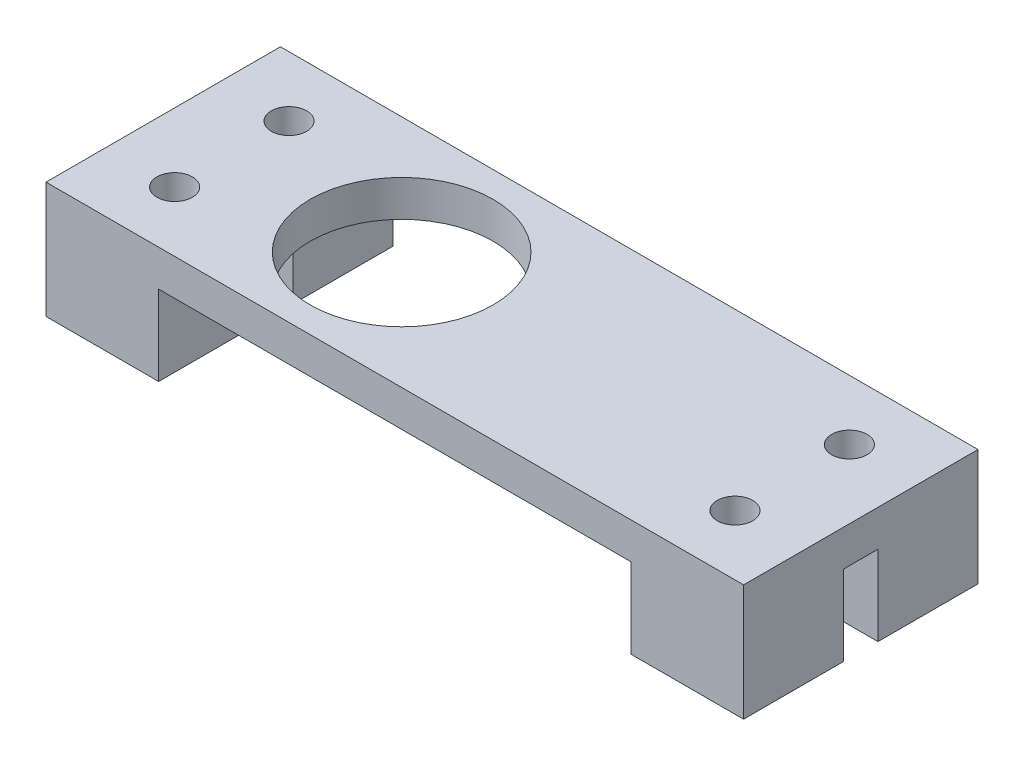
ISO-10303-21;
HEADER;
FILE_DESCRIPTION(('STEP AP214'),'2;1');
FILE_NAME('part.step','',(''),(''),'','','');
FILE_SCHEMA(('AUTOMOTIVE_DESIGN { 1 0 10303 214 1 1 1 1 }'));
ENDSEC;
DATA;
#1=APPLICATION_CONTEXT('core data for automotive mechanical design processes');
#2=APPLICATION_PROTOCOL_DEFINITION('international standard','automotive_design',2000,#1);
#3=PRODUCT_CONTEXT('',#1,'mechanical');
#4=PRODUCT('Part','Part','',(#3));
#5=PRODUCT_RELATED_PRODUCT_CATEGORY('part','',(#4));
#6=PRODUCT_DEFINITION_FORMATION('','',#4);
#7=PRODUCT_DEFINITION_CONTEXT('part definition',#1,'design');
#8=PRODUCT_DEFINITION('design','',#6,#7);
#9=PRODUCT_DEFINITION_SHAPE('','',#8);
#10=(LENGTH_UNIT() NAMED_UNIT(*) SI_UNIT(.MILLI.,.METRE.));
#11=(NAMED_UNIT(*) PLANE_ANGLE_UNIT() SI_UNIT($,.RADIAN.));
#12=(NAMED_UNIT(*) SI_UNIT($,.STERADIAN.) SOLID_ANGLE_UNIT());
#13=UNCERTAINTY_MEASURE_WITH_UNIT(LENGTH_MEASURE(1.E-05),#10,'distance_accuracy_value','');
#14=(GEOMETRIC_REPRESENTATION_CONTEXT(3) GLOBAL_UNCERTAINTY_ASSIGNED_CONTEXT((#13)) GLOBAL_UNIT_ASSIGNED_CONTEXT((#10,
#11,#12)) REPRESENTATION_CONTEXT('',''));
#15=CARTESIAN_POINT('',(0.,0.,0.));
#16=DIRECTION('',(0.,0.,1.));
#17=DIRECTION('',(1.,0.,0.));
#18=AXIS2_PLACEMENT_3D('',#15,#16,#17);
#19=CARTESIAN_POINT('',(0.,0.,0.));
#20=DIRECTION('',(0.,1.,0.));
#21=DIRECTION('',(0.,0.,1.));
#22=AXIS2_PLACEMENT_3D('',#19,#20,#21);
#23=PLANE('',#22);
#24=CARTESIAN_POINT('',(-9.65,0.,0.));
#25=DIRECTION('',(0.,1.,0.));
#26=DIRECTION('',(0.,0.,1.));
#27=AXIS2_PLACEMENT_3D('',#24,#25,#26);
#28=CIRCLE('',#27,8.);
#29=CARTESIAN_POINT('',(-9.65,0.,8.));
#30=VERTEX_POINT('',#29);
#31=EDGE_CURVE('E262',#30,#30,#28,.T.);
#32=ORIENTED_EDGE('',*,*,#31,.T.);
#33=EDGE_LOOP('',(#32));
#34=FACE_BOUND('',#33,.T.);
#35=DIRECTION('',(0.,0.,-1.));
#36=VECTOR('',#35,1.);
#37=CARTESIAN_POINT('',(20.65,0.,0.));
#38=LINE('',#37,#36);
#39=CARTESIAN_POINT('',(20.65,0.,-1.5));
#40=VERTEX_POINT('',#39);
#41=CARTESIAN_POINT('',(20.65,0.,-10.25));
#42=VERTEX_POINT('',#41);
#43=EDGE_CURVE('E52',#40,#42,#38,.T.);
#44=ORIENTED_EDGE('',*,*,#43,.F.);
#45=DIRECTION('',(1.,0.,0.));
#46=VECTOR('',#45,1.);
#47=CARTESIAN_POINT('',(0.,0.,-1.5));
#48=LINE('',#47,#46);
#49=CARTESIAN_POINT('',(30.5,0.,-1.5));
#50=VERTEX_POINT('',#49);
#51=EDGE_CURVE('E57',#40,#50,#48,.T.);
#52=ORIENTED_EDGE('',*,*,#51,.T.);
#53=DIRECTION('',(0.,0.,1.));
#54=VECTOR('',#53,1.);
#55=CARTESIAN_POINT('',(30.5,0.,0.));
#56=LINE('',#55,#54);
#57=CARTESIAN_POINT('',(30.5,0.,1.5));
#58=VERTEX_POINT('',#57);
#59=EDGE_CURVE('E293',#50,#58,#56,.T.);
#60=ORIENTED_EDGE('',*,*,#59,.T.);
#61=DIRECTION('',(1.,0.,0.));
#62=VECTOR('',#61,1.);
#63=CARTESIAN_POINT('',(0.,0.,1.5));
#64=LINE('',#63,#62);
#65=CARTESIAN_POINT('',(20.65,0.,1.5));
#66=VERTEX_POINT('',#65);
#67=EDGE_CURVE('E187',#66,#58,#64,.T.);
#68=ORIENTED_EDGE('',*,*,#67,.F.);
#69=DIRECTION('',(0.,0.,-1.));
#70=VECTOR('',#69,1.);
#71=CARTESIAN_POINT('',(20.65,0.,0.));
#72=LINE('',#71,#70);
#73=CARTESIAN_POINT('',(20.65,0.,10.25));
#74=VERTEX_POINT('',#73);
#75=EDGE_CURVE('E154',#74,#66,#72,.T.);
#76=ORIENTED_EDGE('',*,*,#75,.F.);
#77=DIRECTION('',(1.,0.,0.));
#78=VECTOR('',#77,1.);
#79=CARTESIAN_POINT('',(0.,0.,10.25));
#80=LINE('',#79,#78);
#81=CARTESIAN_POINT('',(-20.65,0.,10.25));
#82=VERTEX_POINT('',#81);
#83=EDGE_CURVE('E267',#82,#74,#80,.T.);
#84=ORIENTED_EDGE('',*,*,#83,.F.);
#85=DIRECTION('',(0.,0.,-1.));
#86=VECTOR('',#85,1.);
#87=CARTESIAN_POINT('',(-20.65,0.,0.));
#88=LINE('',#87,#86);
#89=CARTESIAN_POINT('',(-20.65,0.,1.5));
#90=VERTEX_POINT('',#89);
#91=EDGE_CURVE('E239',#82,#90,#88,.T.);
#92=ORIENTED_EDGE('',*,*,#91,.T.);
#93=DIRECTION('',(1.,0.,0.));
#94=VECTOR('',#93,1.);
#95=CARTESIAN_POINT('',(0.,0.,1.5));
#96=LINE('',#95,#94);
#97=CARTESIAN_POINT('',(-30.5,0.,1.5));
#98=VERTEX_POINT('',#97);
#99=EDGE_CURVE('E234',#98,#90,#96,.T.);
#100=ORIENTED_EDGE('',*,*,#99,.F.);
#101=DIRECTION('',(0.,0.,1.));
#102=VECTOR('',#101,1.);
#103=CARTESIAN_POINT('',(-30.5,0.,0.));
#104=LINE('',#103,#102);
#105=CARTESIAN_POINT('',(-30.5,0.,-1.5));
#106=VERTEX_POINT('',#105);
#107=EDGE_CURVE('E297',#106,#98,#104,.T.);
#108=ORIENTED_EDGE('',*,*,#107,.F.);
#109=DIRECTION('',(1.,0.,0.));
#110=VECTOR('',#109,1.);
#111=CARTESIAN_POINT('',(0.,0.,-1.5));
#112=LINE('',#111,#110);
#113=CARTESIAN_POINT('',(-20.65,0.,-1.5));
#114=VERTEX_POINT('',#113);
#115=EDGE_CURVE('E208',#106,#114,#112,.T.);
#116=ORIENTED_EDGE('',*,*,#115,.T.);
#117=DIRECTION('',(0.,0.,-1.));
#118=VECTOR('',#117,1.);
#119=CARTESIAN_POINT('',(-20.65,0.,0.));
#120=LINE('',#119,#118);
#121=CARTESIAN_POINT('',(-20.65,0.,-10.25));
#122=VERTEX_POINT('',#121);
#123=EDGE_CURVE('E213',#114,#122,#120,.T.);
#124=ORIENTED_EDGE('',*,*,#123,.T.);
#125=DIRECTION('',(1.,0.,0.));
#126=VECTOR('',#125,1.);
#127=CARTESIAN_POINT('',(0.,0.,-10.25));
#128=LINE('',#127,#126);
#129=EDGE_CURVE('E295',#122,#42,#128,.T.);
#130=ORIENTED_EDGE('',*,*,#129,.T.);
#131=EDGE_LOOP('',(#44,#52,#60,#68,#76,#84,#92,#100,#108,#116,#124,#130));
#132=FACE_BOUND('',#131,.T.);
#133=ADVANCED_FACE('F37',(#34,#132),#23,.F.);
#134=CARTESIAN_POINT('',(30.5,3.175,0.));
#135=DIRECTION('',(1.,0.,0.));
#136=DIRECTION('',(0.,0.,-1.));
#137=AXIS2_PLACEMENT_3D('',#134,#135,#136);
#138=PLANE('',#137);
#139=ORIENTED_EDGE('',*,*,#59,.F.);
#140=DIRECTION('',(0.,1.,0.));
#141=VECTOR('',#140,1.);
#142=CARTESIAN_POINT('',(30.5,-7.,-1.5));
#143=LINE('',#142,#141);
#144=CARTESIAN_POINT('',(30.5,-7.,-1.5));
#145=VERTEX_POINT('',#144);
#146=EDGE_CURVE('E179',#145,#50,#143,.T.);
#147=ORIENTED_EDGE('',*,*,#146,.F.);
#148=DIRECTION('',(0.,0.,1.));
#149=VECTOR('',#148,1.);
#150=CARTESIAN_POINT('',(30.5,-7.,0.));
#151=LINE('',#150,#149);
#152=CARTESIAN_POINT('',(30.5,-7.,-10.25));
#153=VERTEX_POINT('',#152);
#154=EDGE_CURVE('E169',#153,#145,#151,.T.);
#155=ORIENTED_EDGE('',*,*,#154,.F.);
#156=DIRECTION('',(0.,-1.,0.));
#157=VECTOR('',#156,1.);
#158=CARTESIAN_POINT('',(30.5,3.175,-10.25));
#159=LINE('',#158,#157);
#160=CARTESIAN_POINT('',(30.5,3.175,-10.25));
#161=VERTEX_POINT('',#160);
#162=EDGE_CURVE('E11',#161,#153,#159,.T.);
#163=ORIENTED_EDGE('',*,*,#162,.F.);
#164=DIRECTION('',(0.,0.,1.));
#165=VECTOR('',#164,1.);
#166=CARTESIAN_POINT('',(30.5,3.175,0.));
#167=LINE('',#166,#165);
#168=CARTESIAN_POINT('',(30.5,3.175,10.25));
#169=VERTEX_POINT('',#168);
#170=EDGE_CURVE('E279',#161,#169,#167,.T.);
#171=ORIENTED_EDGE('',*,*,#170,.T.);
#172=DIRECTION('',(0.,-1.,0.));
#173=VECTOR('',#172,1.);
#174=CARTESIAN_POINT('',(30.5,3.175,10.25));
#175=LINE('',#174,#173);
#176=CARTESIAN_POINT('',(30.5,-7.,10.25));
#177=VERTEX_POINT('',#176);
#178=EDGE_CURVE('E290',#169,#177,#175,.T.);
#179=ORIENTED_EDGE('',*,*,#178,.T.);
#180=DIRECTION('',(0.,0.,1.));
#181=VECTOR('',#180,1.);
#182=CARTESIAN_POINT('',(30.5,-7.,0.));
#183=LINE('',#182,#181);
#184=CARTESIAN_POINT('',(30.5,-7.,1.5));
#185=VERTEX_POINT('',#184);
#186=EDGE_CURVE('E192',#185,#177,#183,.T.);
#187=ORIENTED_EDGE('',*,*,#186,.F.);
#188=DIRECTION('',(0.,1.,0.));
#189=VECTOR('',#188,1.);
#190=CARTESIAN_POINT('',(30.5,-7.,1.5));
#191=LINE('',#190,#189);
#192=EDGE_CURVE('E203',#185,#58,#191,.T.);
#193=ORIENTED_EDGE('',*,*,#192,.T.);
#194=EDGE_LOOP('',(#139,#147,#155,#163,#171,#179,#187,#193));
#195=FACE_BOUND('',#194,.T.);
#196=ADVANCED_FACE('F345',(#195),#138,.T.);
#197=CARTESIAN_POINT('',(0.,3.175,-10.25));
#198=DIRECTION('',(0.,0.,-1.));
#199=DIRECTION('',(-1.,0.,0.));
#200=AXIS2_PLACEMENT_3D('',#197,#198,#199);
#201=PLANE('',#200);
#202=ORIENTED_EDGE('',*,*,#129,.F.);
#203=DIRECTION('',(0.,1.,0.));
#204=VECTOR('',#203,1.);
#205=CARTESIAN_POINT('',(-20.65,-7.,-10.25));
#206=LINE('',#205,#204);
#207=CARTESIAN_POINT('',(-20.65,-7.,-10.25));
#208=VERTEX_POINT('',#207);
#209=EDGE_CURVE('E230',#208,#122,#206,.T.);
#210=ORIENTED_EDGE('',*,*,#209,.F.);
#211=DIRECTION('',(1.,0.,0.));
#212=VECTOR('',#211,1.);
#213=CARTESIAN_POINT('',(0.,-7.,-10.25));
#214=LINE('',#213,#212);
#215=CARTESIAN_POINT('',(-30.5,-7.,-10.25));
#216=VERTEX_POINT('',#215);
#217=EDGE_CURVE('E216',#216,#208,#214,.T.);
#218=ORIENTED_EDGE('',*,*,#217,.F.);
#219=DIRECTION('',(0.,-1.,0.));
#220=VECTOR('',#219,1.);
#221=CARTESIAN_POINT('',(-30.5,3.175,-10.25));
#222=LINE('',#221,#220);
#223=CARTESIAN_POINT('',(-30.5,3.175,-10.25));
#224=VERTEX_POINT('',#223);
#225=EDGE_CURVE('E45',#224,#216,#222,.T.);
#226=ORIENTED_EDGE('',*,*,#225,.F.);
#227=DIRECTION('',(1.,0.,0.));
#228=VECTOR('',#227,1.);
#229=CARTESIAN_POINT('',(0.,3.175,-10.25));
#230=LINE('',#229,#228);
#231=EDGE_CURVE('E282',#224,#161,#230,.T.);
#232=ORIENTED_EDGE('',*,*,#231,.T.);
#233=ORIENTED_EDGE('',*,*,#162,.T.);
#234=DIRECTION('',(1.,0.,0.));
#235=VECTOR('',#234,1.);
#236=CARTESIAN_POINT('',(0.,-7.,-10.25));
#237=LINE('',#236,#235);
#238=CARTESIAN_POINT('',(20.65,-7.,-10.25));
#239=VERTEX_POINT('',#238);
#240=EDGE_CURVE('E164',#239,#153,#237,.T.);
#241=ORIENTED_EDGE('',*,*,#240,.F.);
#242=DIRECTION('',(0.,1.,0.));
#243=VECTOR('',#242,1.);
#244=CARTESIAN_POINT('',(20.65,-7.,-10.25));
#245=LINE('',#244,#243);
#246=EDGE_CURVE('E155',#239,#42,#245,.T.);
#247=ORIENTED_EDGE('',*,*,#246,.T.);
#248=EDGE_LOOP('',(#202,#210,#218,#226,#232,#233,#241,#247));
#249=FACE_BOUND('',#248,.T.);
#250=ADVANCED_FACE('F318',(#249),#201,.T.);
#251=CARTESIAN_POINT('',(-30.5,3.175,0.));
#252=DIRECTION('',(1.,0.,0.));
#253=DIRECTION('',(0.,0.,-1.));
#254=AXIS2_PLACEMENT_3D('',#251,#252,#253);
#255=PLANE('',#254);
#256=ORIENTED_EDGE('',*,*,#225,.T.);
#257=DIRECTION('',(0.,0.,-1.));
#258=VECTOR('',#257,1.);
#259=CARTESIAN_POINT('',(-30.5,-7.,0.));
#260=LINE('',#259,#258);
#261=CARTESIAN_POINT('',(-30.5,-7.,-1.5));
#262=VERTEX_POINT('',#261);
#263=EDGE_CURVE('E212',#262,#216,#260,.T.);
#264=ORIENTED_EDGE('',*,*,#263,.F.);
#265=DIRECTION('',(0.,1.,0.));
#266=VECTOR('',#265,1.);
#267=CARTESIAN_POINT('',(-30.5,-7.,-1.5));
#268=LINE('',#267,#266);
#269=EDGE_CURVE('E232',#262,#106,#268,.T.);
#270=ORIENTED_EDGE('',*,*,#269,.T.);
#271=ORIENTED_EDGE('',*,*,#107,.T.);
#272=DIRECTION('',(0.,1.,0.));
#273=VECTOR('',#272,1.);
#274=CARTESIAN_POINT('',(-30.5,-7.,1.5));
#275=LINE('',#274,#273);
#276=CARTESIAN_POINT('',(-30.5,-7.,1.5));
#277=VERTEX_POINT('',#276);
#278=EDGE_CURVE('E259',#277,#98,#275,.T.);
#279=ORIENTED_EDGE('',*,*,#278,.F.);
#280=DIRECTION('',(0.,0.,-1.));
#281=VECTOR('',#280,1.);
#282=CARTESIAN_POINT('',(-30.5,-7.,0.));
#283=LINE('',#282,#281);
#284=CARTESIAN_POINT('',(-30.5,-7.,10.25));
#285=VERTEX_POINT('',#284);
#286=EDGE_CURVE('E238',#285,#277,#283,.T.);
#287=ORIENTED_EDGE('',*,*,#286,.F.);
#288=DIRECTION('',(0.,-1.,0.));
#289=VECTOR('',#288,1.);
#290=CARTESIAN_POINT('',(-30.5,3.175,10.25));
#291=LINE('',#290,#289);
#292=CARTESIAN_POINT('',(-30.5,3.175,10.25));
#293=VERTEX_POINT('',#292);
#294=EDGE_CURVE('E302',#293,#285,#291,.T.);
#295=ORIENTED_EDGE('',*,*,#294,.F.);
#296=DIRECTION('',(0.,0.,1.));
#297=VECTOR('',#296,1.);
#298=CARTESIAN_POINT('',(-30.5,3.175,0.));
#299=LINE('',#298,#297);
#300=EDGE_CURVE('E285',#224,#293,#299,.T.);
#301=ORIENTED_EDGE('',*,*,#300,.F.);
#302=EDGE_LOOP('',(#256,#264,#270,#271,#279,#287,#295,#301));
#303=FACE_BOUND('',#302,.T.);
#304=ADVANCED_FACE('F306',(#303),#255,.F.);
#305=CARTESIAN_POINT('',(-9.65,3.175,0.));
#306=DIRECTION('',(0.,-1.,0.));
#307=DIRECTION('',(0.,0.,-1.));
#308=AXIS2_PLACEMENT_3D('',#305,#306,#307);
#309=CYLINDRICAL_SURFACE('',#308,8.);
#310=CARTESIAN_POINT('',(-9.65,3.175,0.));
#311=DIRECTION('',(0.,1.,0.));
#312=DIRECTION('',(0.,0.,1.));
#313=AXIS2_PLACEMENT_3D('',#310,#311,#312);
#314=CIRCLE('',#313,8.);
#315=CARTESIAN_POINT('',(-9.65,3.175,8.));
#316=VERTEX_POINT('',#315);
#317=EDGE_CURVE('E276',#316,#316,#314,.T.);
#318=ORIENTED_EDGE('',*,*,#317,.T.);
#319=EDGE_LOOP('',(#318));
#320=FACE_BOUND('',#319,.T.);
#321=ORIENTED_EDGE('',*,*,#31,.F.);
#322=EDGE_LOOP('',(#321));
#323=FACE_BOUND('',#322,.T.);
#324=ADVANCED_FACE('F381',(#320,#323),#309,.F.);
#325=CARTESIAN_POINT('',(-24.5,3.175,-5.));
#326=DIRECTION('',(0.,-1.,0.));
#327=DIRECTION('',(0.,0.,-1.));
#328=AXIS2_PLACEMENT_3D('',#325,#326,#327);
#329=CYLINDRICAL_SURFACE('',#328,1.55);
#330=CARTESIAN_POINT('',(-24.5,3.175,-5.));
#331=DIRECTION('',(0.,1.,0.));
#332=DIRECTION('',(0.,0.,1.));
#333=AXIS2_PLACEMENT_3D('',#330,#331,#332);
#334=CIRCLE('',#333,1.55);
#335=CARTESIAN_POINT('',(-24.5,3.175,-3.45));
#336=VERTEX_POINT('',#335);
#337=EDGE_CURVE('E273',#336,#336,#334,.T.);
#338=ORIENTED_EDGE('',*,*,#337,.T.);
#339=EDGE_LOOP('',(#338));
#340=FACE_BOUND('',#339,.T.);
#341=CARTESIAN_POINT('',(-24.5,-7.,-5.));
#342=DIRECTION('',(0.,-1.,0.));
#343=DIRECTION('',(0.,0.,-1.));
#344=AXIS2_PLACEMENT_3D('',#341,#342,#343);
#345=CIRCLE('',#344,1.55);
#346=CARTESIAN_POINT('',(-24.5,-7.,-6.55));
#347=VERTEX_POINT('',#346);
#348=EDGE_CURVE('E221',#347,#347,#345,.F.);
#349=ORIENTED_EDGE('',*,*,#348,.F.);
#350=EDGE_LOOP('',(#349));
#351=FACE_BOUND('',#350,.T.);
#352=ADVANCED_FACE('F386',(#340,#351),#329,.F.);
#353=CARTESIAN_POINT('',(-24.5,3.175,5.));
#354=DIRECTION('',(0.,-1.,0.));
#355=DIRECTION('',(0.,0.,-1.));
#356=AXIS2_PLACEMENT_3D('',#353,#354,#355);
#357=CYLINDRICAL_SURFACE('',#356,1.55);
#358=CARTESIAN_POINT('',(-24.5,3.175,5.));
#359=DIRECTION('',(0.,1.,0.));
#360=DIRECTION('',(0.,0.,1.));
#361=AXIS2_PLACEMENT_3D('',#358,#359,#360);
#362=CIRCLE('',#361,1.55);
#363=CARTESIAN_POINT('',(-24.5,3.175,6.55));
#364=VERTEX_POINT('',#363);
#365=EDGE_CURVE('E270',#364,#364,#362,.T.);
#366=ORIENTED_EDGE('',*,*,#365,.T.);
#367=EDGE_LOOP('',(#366));
#368=FACE_BOUND('',#367,.T.);
#369=CARTESIAN_POINT('',(-24.5,-7.,5.));
#370=DIRECTION('',(0.,-1.,0.));
#371=DIRECTION('',(0.,0.,-1.));
#372=AXIS2_PLACEMENT_3D('',#369,#370,#371);
#373=CIRCLE('',#372,1.55);
#374=CARTESIAN_POINT('',(-24.5,-7.,3.45));
#375=VERTEX_POINT('',#374);
#376=EDGE_CURVE('E235',#375,#375,#373,.F.);
#377=ORIENTED_EDGE('',*,*,#376,.F.);
#378=EDGE_LOOP('',(#377));
#379=FACE_BOUND('',#378,.T.);
#380=ADVANCED_FACE('F390',(#368,#379),#357,.F.);
#381=CARTESIAN_POINT('',(24.5,3.175,-5.00000000000001));
#382=DIRECTION('',(0.,-1.,0.));
#383=DIRECTION('',(0.,0.,-1.));
#384=AXIS2_PLACEMENT_3D('',#381,#382,#383);
#385=CYLINDRICAL_SURFACE('',#384,1.55);
#386=CARTESIAN_POINT('',(24.5,3.175,-5.00000000000001));
#387=DIRECTION('',(0.,1.,0.));
#388=DIRECTION('',(0.,0.,1.));
#389=AXIS2_PLACEMENT_3D('',#386,#387,#388);
#390=CIRCLE('',#389,1.55);
#391=CARTESIAN_POINT('',(24.5,3.175,-3.45000000000001));
#392=VERTEX_POINT('',#391);
#393=EDGE_CURVE('E266',#392,#392,#390,.T.);
#394=ORIENTED_EDGE('',*,*,#393,.T.);
#395=EDGE_LOOP('',(#394));
#396=FACE_BOUND('',#395,.T.);
#397=CARTESIAN_POINT('',(24.5,-7.,-5.00000000000001));
#398=DIRECTION('',(0.,-1.,0.));
#399=DIRECTION('',(0.,0.,-1.));
#400=AXIS2_PLACEMENT_3D('',#397,#398,#399);
#401=CIRCLE('',#400,1.55);
#402=CARTESIAN_POINT('',(24.5,-7.,-6.55000000000001));
#403=VERTEX_POINT('',#402);
#404=EDGE_CURVE('E176',#403,#403,#401,.F.);
#405=ORIENTED_EDGE('',*,*,#404,.F.);
#406=EDGE_LOOP('',(#405));
#407=FACE_BOUND('',#406,.T.);
#408=ADVANCED_FACE('F393',(#396,#407),#385,.F.);
#409=CARTESIAN_POINT('',(24.5,3.175,5.00000000000001));
#410=DIRECTION('',(0.,-1.,0.));
#411=DIRECTION('',(0.,0.,-1.));
#412=AXIS2_PLACEMENT_3D('',#409,#410,#411);
#413=CYLINDRICAL_SURFACE('',#412,1.55);
#414=CARTESIAN_POINT('',(24.5,3.175,5.00000000000001));
#415=DIRECTION('',(0.,1.,0.));
#416=DIRECTION('',(0.,0.,1.));
#417=AXIS2_PLACEMENT_3D('',#414,#415,#416);
#418=CIRCLE('',#417,1.55);
#419=CARTESIAN_POINT('',(24.5,3.175,6.55000000000001));
#420=VERTEX_POINT('',#419);
#421=EDGE_CURVE('E263',#420,#420,#418,.T.);
#422=ORIENTED_EDGE('',*,*,#421,.T.);
#423=EDGE_LOOP('',(#422));
#424=FACE_BOUND('',#423,.T.);
#425=CARTESIAN_POINT('',(24.5,-7.,5.00000000000001));
#426=DIRECTION('',(0.,-1.,0.));
#427=DIRECTION('',(0.,0.,-1.));
#428=AXIS2_PLACEMENT_3D('',#425,#426,#427);
#429=CIRCLE('',#428,1.55);
#430=CARTESIAN_POINT('',(24.5,-7.,3.45000000000001));
#431=VERTEX_POINT('',#430);
#432=EDGE_CURVE('E183',#431,#431,#429,.F.);
#433=ORIENTED_EDGE('',*,*,#432,.F.);
#434=EDGE_LOOP('',(#433));
#435=FACE_BOUND('',#434,.T.);
#436=ADVANCED_FACE('F39',(#424,#435),#413,.F.);
#437=CARTESIAN_POINT('',(0.,3.175,10.25));
#438=DIRECTION('',(0.,0.,-1.));
#439=DIRECTION('',(-1.,0.,0.));
#440=AXIS2_PLACEMENT_3D('',#437,#438,#439);
#441=PLANE('',#440);
#442=ORIENTED_EDGE('',*,*,#294,.T.);
#443=DIRECTION('',(-1.,0.,0.));
#444=VECTOR('',#443,1.);
#445=CARTESIAN_POINT('',(0.,-7.,10.25));
#446=LINE('',#445,#444);
#447=CARTESIAN_POINT('',(-20.65,-7.,10.25));
#448=VERTEX_POINT('',#447);
#449=EDGE_CURVE('E247',#448,#285,#446,.T.);
#450=ORIENTED_EDGE('',*,*,#449,.F.);
#451=DIRECTION('',(0.,1.,0.));
#452=VECTOR('',#451,1.);
#453=CARTESIAN_POINT('',(-20.65,-7.,10.25));
#454=LINE('',#453,#452);
#455=EDGE_CURVE('E250',#448,#82,#454,.T.);
#456=ORIENTED_EDGE('',*,*,#455,.T.);
#457=ORIENTED_EDGE('',*,*,#83,.T.);
#458=DIRECTION('',(0.,1.,0.));
#459=VECTOR('',#458,1.);
#460=CARTESIAN_POINT('',(20.65,-7.,10.25));
#461=LINE('',#460,#459);
#462=CARTESIAN_POINT('',(20.65,-7.,10.25));
#463=VERTEX_POINT('',#462);
#464=EDGE_CURVE('E197',#463,#74,#461,.T.);
#465=ORIENTED_EDGE('',*,*,#464,.F.);
#466=DIRECTION('',(-1.,0.,0.));
#467=VECTOR('',#466,1.);
#468=CARTESIAN_POINT('',(0.,-7.,10.25));
#469=LINE('',#468,#467);
#470=EDGE_CURVE('E195',#177,#463,#469,.T.);
#471=ORIENTED_EDGE('',*,*,#470,.F.);
#472=ORIENTED_EDGE('',*,*,#178,.F.);
#473=DIRECTION('',(1.,0.,0.));
#474=VECTOR('',#473,1.);
#475=CARTESIAN_POINT('',(0.,3.175,10.25));
#476=LINE('',#475,#474);
#477=EDGE_CURVE('E288',#293,#169,#476,.T.);
#478=ORIENTED_EDGE('',*,*,#477,.F.);
#479=EDGE_LOOP('',(#442,#450,#456,#457,#465,#471,#472,#478));
#480=FACE_BOUND('',#479,.T.);
#481=ADVANCED_FACE('F338',(#480),#441,.F.);
#482=CARTESIAN_POINT('',(0.,3.175,0.));
#483=DIRECTION('',(0.,1.,0.));
#484=DIRECTION('',(0.,0.,1.));
#485=AXIS2_PLACEMENT_3D('',#482,#483,#484);
#486=PLANE('',#485);
#487=ORIENTED_EDGE('',*,*,#421,.F.);
#488=EDGE_LOOP('',(#487));
#489=FACE_BOUND('',#488,.T.);
#490=ORIENTED_EDGE('',*,*,#393,.F.);
#491=EDGE_LOOP('',(#490));
#492=FACE_BOUND('',#491,.T.);
#493=ORIENTED_EDGE('',*,*,#365,.F.);
#494=EDGE_LOOP('',(#493));
#495=FACE_BOUND('',#494,.T.);
#496=ORIENTED_EDGE('',*,*,#337,.F.);
#497=EDGE_LOOP('',(#496));
#498=FACE_BOUND('',#497,.T.);
#499=ORIENTED_EDGE('',*,*,#317,.F.);
#500=EDGE_LOOP('',(#499));
#501=FACE_BOUND('',#500,.T.);
#502=ORIENTED_EDGE('',*,*,#170,.F.);
#503=ORIENTED_EDGE('',*,*,#231,.F.);
#504=ORIENTED_EDGE('',*,*,#300,.T.);
#505=ORIENTED_EDGE('',*,*,#477,.T.);
#506=EDGE_LOOP('',(#502,#503,#504,#505));
#507=FACE_BOUND('',#506,.T.);
#508=ADVANCED_FACE('F343',(#489,#492,#495,#498,#501,#507),#486,.T.);
#509=CARTESIAN_POINT('',(0.,-7.,1.5));
#510=DIRECTION('',(0.,0.,1.));
#511=DIRECTION('',(1.,0.,0.));
#512=AXIS2_PLACEMENT_3D('',#509,#510,#511);
#513=PLANE('',#512);
#514=ORIENTED_EDGE('',*,*,#99,.T.);
#515=DIRECTION('',(0.,1.,0.));
#516=VECTOR('',#515,1.);
#517=CARTESIAN_POINT('',(-20.65,-7.,1.5));
#518=LINE('',#517,#516);
#519=CARTESIAN_POINT('',(-20.65,-7.,1.5));
#520=VERTEX_POINT('',#519);
#521=EDGE_CURVE('E256',#520,#90,#518,.T.);
#522=ORIENTED_EDGE('',*,*,#521,.F.);
#523=DIRECTION('',(1.,0.,0.));
#524=VECTOR('',#523,1.);
#525=CARTESIAN_POINT('',(0.,-7.,1.5));
#526=LINE('',#525,#524);
#527=EDGE_CURVE('E242',#277,#520,#526,.T.);
#528=ORIENTED_EDGE('',*,*,#527,.F.);
#529=ORIENTED_EDGE('',*,*,#278,.T.);
#530=EDGE_LOOP('',(#514,#522,#528,#529));
#531=FACE_BOUND('',#530,.T.);
#532=ADVANCED_FACE('F332',(#531),#513,.F.);
#533=CARTESIAN_POINT('',(-20.65,-7.,0.));
#534=DIRECTION('',(1.,0.,0.));
#535=DIRECTION('',(0.,0.,-1.));
#536=AXIS2_PLACEMENT_3D('',#533,#534,#535);
#537=PLANE('',#536);
#538=ORIENTED_EDGE('',*,*,#91,.F.);
#539=ORIENTED_EDGE('',*,*,#455,.F.);
#540=DIRECTION('',(0.,0.,-1.));
#541=VECTOR('',#540,1.);
#542=CARTESIAN_POINT('',(-20.65,-7.,0.));
#543=LINE('',#542,#541);
#544=EDGE_CURVE('E244',#448,#520,#543,.T.);
#545=ORIENTED_EDGE('',*,*,#544,.T.);
#546=ORIENTED_EDGE('',*,*,#521,.T.);
#547=EDGE_LOOP('',(#538,#539,#545,#546));
#548=FACE_BOUND('',#547,.T.);
#549=ADVANCED_FACE('F358',(#548),#537,.T.);
#550=CARTESIAN_POINT('',(0.,-7.,0.));
#551=DIRECTION('',(0.,-1.,0.));
#552=DIRECTION('',(0.,0.,-1.));
#553=AXIS2_PLACEMENT_3D('',#550,#551,#552);
#554=PLANE('',#553);
#555=ORIENTED_EDGE('',*,*,#376,.T.);
#556=EDGE_LOOP('',(#555));
#557=FACE_BOUND('',#556,.T.);
#558=ORIENTED_EDGE('',*,*,#286,.T.);
#559=ORIENTED_EDGE('',*,*,#527,.T.);
#560=ORIENTED_EDGE('',*,*,#544,.F.);
#561=ORIENTED_EDGE('',*,*,#449,.T.);
#562=EDGE_LOOP('',(#558,#559,#560,#561));
#563=FACE_BOUND('',#562,.T.);
#564=ADVANCED_FACE('F335',(#557,#563),#554,.T.);
#565=CARTESIAN_POINT('',(0.,-7.,-1.5));
#566=DIRECTION('',(0.,0.,1.));
#567=DIRECTION('',(1.,0.,0.));
#568=AXIS2_PLACEMENT_3D('',#565,#566,#567);
#569=PLANE('',#568);
#570=ORIENTED_EDGE('',*,*,#115,.F.);
#571=ORIENTED_EDGE('',*,*,#269,.F.);
#572=DIRECTION('',(1.,0.,0.));
#573=VECTOR('',#572,1.);
#574=CARTESIAN_POINT('',(0.,-7.,-1.5));
#575=LINE('',#574,#573);
#576=CARTESIAN_POINT('',(-20.65,-7.,-1.5));
#577=VERTEX_POINT('',#576);
#578=EDGE_CURVE('E209',#262,#577,#575,.T.);
#579=ORIENTED_EDGE('',*,*,#578,.T.);
#580=DIRECTION('',(0.,1.,0.));
#581=VECTOR('',#580,1.);
#582=CARTESIAN_POINT('',(-20.65,-7.,-1.5));
#583=LINE('',#582,#581);
#584=EDGE_CURVE('E224',#577,#114,#583,.T.);
#585=ORIENTED_EDGE('',*,*,#584,.T.);
#586=EDGE_LOOP('',(#570,#571,#579,#585));
#587=FACE_BOUND('',#586,.T.);
#588=ADVANCED_FACE('F324',(#587),#569,.T.);
#589=CARTESIAN_POINT('',(-20.65,-7.,0.));
#590=DIRECTION('',(1.,0.,0.));
#591=DIRECTION('',(0.,0.,-1.));
#592=AXIS2_PLACEMENT_3D('',#589,#590,#591);
#593=PLANE('',#592);
#594=ORIENTED_EDGE('',*,*,#123,.F.);
#595=ORIENTED_EDGE('',*,*,#584,.F.);
#596=DIRECTION('',(0.,0.,-1.));
#597=VECTOR('',#596,1.);
#598=CARTESIAN_POINT('',(-20.65,-7.,0.));
#599=LINE('',#598,#597);
#600=EDGE_CURVE('E218',#577,#208,#599,.T.);
#601=ORIENTED_EDGE('',*,*,#600,.T.);
#602=ORIENTED_EDGE('',*,*,#209,.T.);
#603=EDGE_LOOP('',(#594,#595,#601,#602));
#604=FACE_BOUND('',#603,.T.);
#605=ADVANCED_FACE('F321',(#604),#593,.T.);
#606=CARTESIAN_POINT('',(0.,-7.,0.));
#607=DIRECTION('',(0.,-1.,0.));
#608=DIRECTION('',(0.,0.,-1.));
#609=AXIS2_PLACEMENT_3D('',#606,#607,#608);
#610=PLANE('',#609);
#611=ORIENTED_EDGE('',*,*,#578,.F.);
#612=ORIENTED_EDGE('',*,*,#263,.T.);
#613=ORIENTED_EDGE('',*,*,#217,.T.);
#614=ORIENTED_EDGE('',*,*,#600,.F.);
#615=EDGE_LOOP('',(#611,#612,#613,#614));
#616=FACE_BOUND('',#615,.T.);
#617=ORIENTED_EDGE('',*,*,#348,.T.);
#618=EDGE_LOOP('',(#617));
#619=FACE_BOUND('',#618,.T.);
#620=ADVANCED_FACE('F313',(#616,#619),#610,.T.);
#621=CARTESIAN_POINT('',(20.65,-7.,0.));
#622=DIRECTION('',(1.,0.,0.));
#623=DIRECTION('',(0.,0.,-1.));
#624=AXIS2_PLACEMENT_3D('',#621,#622,#623);
#625=PLANE('',#624);
#626=ORIENTED_EDGE('',*,*,#75,.T.);
#627=DIRECTION('',(0.,1.,0.));
#628=VECTOR('',#627,1.);
#629=CARTESIAN_POINT('',(20.65,-7.,1.5));
#630=LINE('',#629,#628);
#631=CARTESIAN_POINT('',(20.65,-7.,1.5));
#632=VERTEX_POINT('',#631);
#633=EDGE_CURVE('E206',#632,#66,#630,.T.);
#634=ORIENTED_EDGE('',*,*,#633,.F.);
#635=DIRECTION('',(0.,0.,-1.));
#636=VECTOR('',#635,1.);
#637=CARTESIAN_POINT('',(20.65,-7.,0.));
#638=LINE('',#637,#636);
#639=EDGE_CURVE('E186',#463,#632,#638,.T.);
#640=ORIENTED_EDGE('',*,*,#639,.F.);
#641=ORIENTED_EDGE('',*,*,#464,.T.);
#642=EDGE_LOOP('',(#626,#634,#640,#641));
#643=FACE_BOUND('',#642,.T.);
#644=ADVANCED_FACE('F355',(#643),#625,.F.);
#645=CARTESIAN_POINT('',(0.,-7.,1.5));
#646=DIRECTION('',(0.,0.,1.));
#647=DIRECTION('',(1.,0.,0.));
#648=AXIS2_PLACEMENT_3D('',#645,#646,#647);
#649=PLANE('',#648);
#650=ORIENTED_EDGE('',*,*,#67,.T.);
#651=ORIENTED_EDGE('',*,*,#192,.F.);
#652=DIRECTION('',(1.,0.,0.));
#653=VECTOR('',#652,1.);
#654=CARTESIAN_POINT('',(0.,-7.,1.5));
#655=LINE('',#654,#653);
#656=EDGE_CURVE('E190',#632,#185,#655,.T.);
#657=ORIENTED_EDGE('',*,*,#656,.F.);
#658=ORIENTED_EDGE('',*,*,#633,.T.);
#659=EDGE_LOOP('',(#650,#651,#657,#658));
#660=FACE_BOUND('',#659,.T.);
#661=ADVANCED_FACE('F351',(#660),#649,.F.);
#662=CARTESIAN_POINT('',(0.,-7.,0.));
#663=DIRECTION('',(0.,-1.,0.));
#664=DIRECTION('',(0.,0.,-1.));
#665=AXIS2_PLACEMENT_3D('',#662,#663,#664);
#666=PLANE('',#665);
#667=ORIENTED_EDGE('',*,*,#432,.T.);
#668=EDGE_LOOP('',(#667));
#669=FACE_BOUND('',#668,.T.);
#670=ORIENTED_EDGE('',*,*,#639,.T.);
#671=ORIENTED_EDGE('',*,*,#656,.T.);
#672=ORIENTED_EDGE('',*,*,#186,.T.);
#673=ORIENTED_EDGE('',*,*,#470,.T.);
#674=EDGE_LOOP('',(#670,#671,#672,#673));
#675=FACE_BOUND('',#674,.T.);
#676=ADVANCED_FACE('F413',(#669,#675),#666,.T.);
#677=CARTESIAN_POINT('',(0.,-7.,-1.5));
#678=DIRECTION('',(0.,0.,1.));
#679=DIRECTION('',(1.,0.,0.));
#680=AXIS2_PLACEMENT_3D('',#677,#678,#679);
#681=PLANE('',#680);
#682=ORIENTED_EDGE('',*,*,#51,.F.);
#683=DIRECTION('',(0.,1.,0.));
#684=VECTOR('',#683,1.);
#685=CARTESIAN_POINT('',(20.65,-7.,-1.5));
#686=LINE('',#685,#684);
#687=CARTESIAN_POINT('',(20.65,-7.,-1.5));
#688=VERTEX_POINT('',#687);
#689=EDGE_CURVE('E147',#688,#40,#686,.T.);
#690=ORIENTED_EDGE('',*,*,#689,.F.);
#691=DIRECTION('',(1.,0.,0.));
#692=VECTOR('',#691,1.);
#693=CARTESIAN_POINT('',(0.,-7.,-1.5));
#694=LINE('',#693,#692);
#695=EDGE_CURVE('E152',#688,#145,#694,.T.);
#696=ORIENTED_EDGE('',*,*,#695,.T.);
#697=ORIENTED_EDGE('',*,*,#146,.T.);
#698=EDGE_LOOP('',(#682,#690,#696,#697));
#699=FACE_BOUND('',#698,.T.);
#700=ADVANCED_FACE('F149',(#699),#681,.T.);
#701=CARTESIAN_POINT('',(20.65,-7.,0.));
#702=DIRECTION('',(1.,0.,0.));
#703=DIRECTION('',(0.,0.,-1.));
#704=AXIS2_PLACEMENT_3D('',#701,#702,#703);
#705=PLANE('',#704);
#706=ORIENTED_EDGE('',*,*,#43,.T.);
#707=ORIENTED_EDGE('',*,*,#246,.F.);
#708=DIRECTION('',(0.,0.,-1.));
#709=VECTOR('',#708,1.);
#710=CARTESIAN_POINT('',(20.65,-7.,0.));
#711=LINE('',#710,#709);
#712=EDGE_CURVE('E158',#688,#239,#711,.T.);
#713=ORIENTED_EDGE('',*,*,#712,.F.);
#714=ORIENTED_EDGE('',*,*,#689,.T.);
#715=EDGE_LOOP('',(#706,#707,#713,#714));
#716=FACE_BOUND('',#715,.T.);
#717=ADVANCED_FACE('F159',(#716),#705,.F.);
#718=CARTESIAN_POINT('',(0.,-7.,0.));
#719=DIRECTION('',(0.,-1.,0.));
#720=DIRECTION('',(0.,0.,-1.));
#721=AXIS2_PLACEMENT_3D('',#718,#719,#720);
#722=PLANE('',#721);
#723=ORIENTED_EDGE('',*,*,#695,.F.);
#724=ORIENTED_EDGE('',*,*,#712,.T.);
#725=ORIENTED_EDGE('',*,*,#240,.T.);
#726=ORIENTED_EDGE('',*,*,#154,.T.);
#727=EDGE_LOOP('',(#723,#724,#725,#726));
#728=FACE_BOUND('',#727,.T.);
#729=ORIENTED_EDGE('',*,*,#404,.T.);
#730=EDGE_LOOP('',(#729));
#731=FACE_BOUND('',#730,.T.);
#732=ADVANCED_FACE('F166',(#728,#731),#722,.T.);
#733=CLOSED_SHELL('',(#133,#196,#250,#304,#324,#352,#380,#408,#436,#481,#508,#532,#549,#564,
#588,#605,#620,#644,#661,#676,#700,#717,#732));
#734=MANIFOLD_SOLID_BREP('B2',#733);
#735=ADVANCED_BREP_SHAPE_REPRESENTATION('',(#18,#734),#14);
#736=SHAPE_DEFINITION_REPRESENTATION(#9,#735);
ENDSEC;
END-ISO-10303-21;
